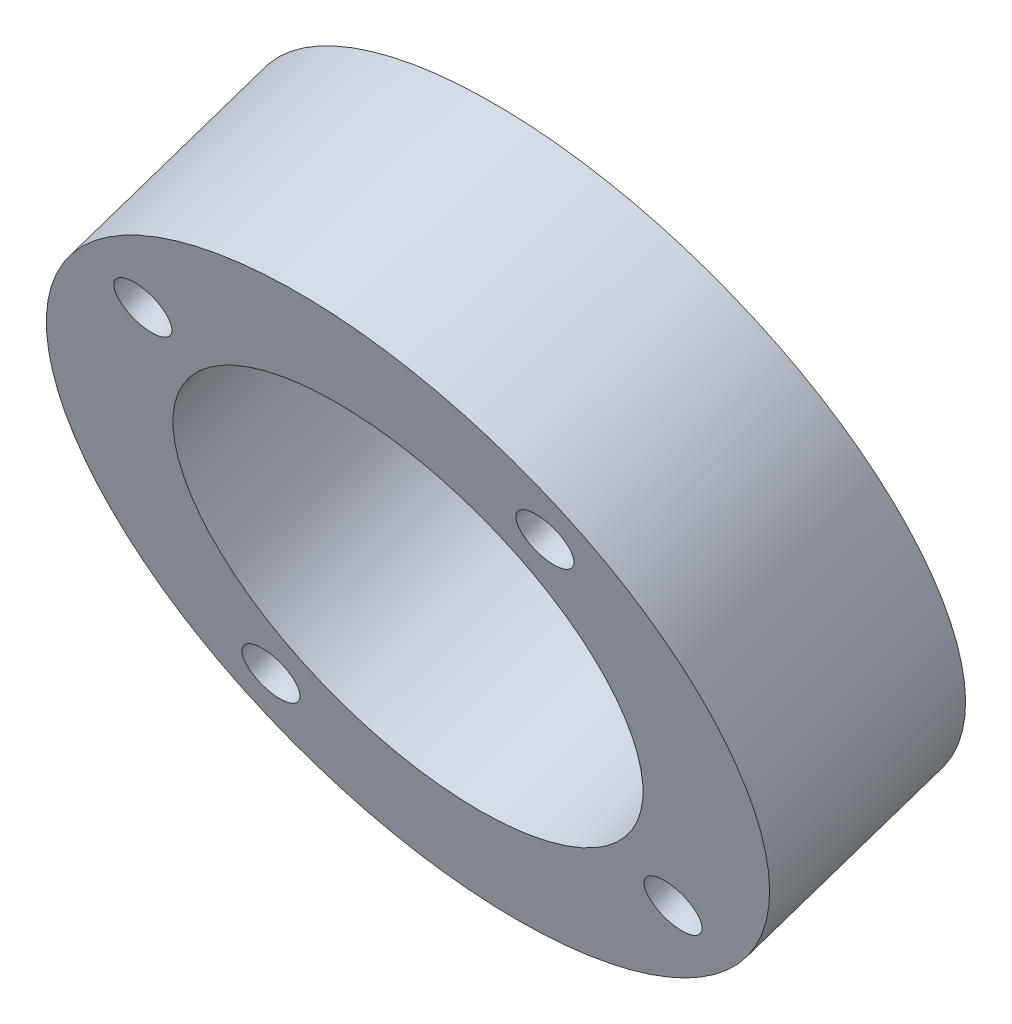
ISO-10303-21;
HEADER;
FILE_DESCRIPTION(('STEP AP214'),'2;1');
FILE_NAME('part.step','',(''),(''),'','','');
FILE_SCHEMA(('AUTOMOTIVE_DESIGN { 1 0 10303 214 1 1 1 1 }'));
ENDSEC;
DATA;
#1=APPLICATION_CONTEXT('core data for automotive mechanical design processes');
#2=APPLICATION_PROTOCOL_DEFINITION('international standard','automotive_design',2000,#1);
#3=PRODUCT_CONTEXT('',#1,'mechanical');
#4=PRODUCT('Part','Part','',(#3));
#5=PRODUCT_RELATED_PRODUCT_CATEGORY('part','',(#4));
#6=PRODUCT_DEFINITION_FORMATION('','',#4);
#7=PRODUCT_DEFINITION_CONTEXT('part definition',#1,'design');
#8=PRODUCT_DEFINITION('design','',#6,#7);
#9=PRODUCT_DEFINITION_SHAPE('','',#8);
#10=(LENGTH_UNIT() NAMED_UNIT(*) SI_UNIT(.MILLI.,.METRE.));
#11=(NAMED_UNIT(*) PLANE_ANGLE_UNIT() SI_UNIT($,.RADIAN.));
#12=(NAMED_UNIT(*) SI_UNIT($,.STERADIAN.) SOLID_ANGLE_UNIT());
#13=UNCERTAINTY_MEASURE_WITH_UNIT(LENGTH_MEASURE(1.E-05),#10,'distance_accuracy_value','');
#14=(GEOMETRIC_REPRESENTATION_CONTEXT(3) GLOBAL_UNCERTAINTY_ASSIGNED_CONTEXT((#13)) GLOBAL_UNIT_ASSIGNED_CONTEXT((#10,
#11,#12)) REPRESENTATION_CONTEXT('',''));
#15=CARTESIAN_POINT('',(0.,0.,0.));
#16=DIRECTION('',(0.,0.,1.));
#17=DIRECTION('',(1.,0.,0.));
#18=AXIS2_PLACEMENT_3D('',#15,#16,#17);
#19=CARTESIAN_POINT('',(-6.05407193696172E-12,474.564066525897,1388.52055057683));
#20=DIRECTION('',(0.,0.31862935507562,-0.947879387941364));
#21=DIRECTION('',(0.,0.947879387941364,0.31862935507562));
#22=AXIS2_PLACEMENT_3D('',#19,#20,#21);
#23=CYLINDRICAL_SURFACE('',#22,31.7500000000517);
#24=CARTESIAN_POINT('',(0.,509.247687902839,1285.34145148044));
#25=DIRECTION('',(0.,-0.31862935507562,0.947879387941364));
#26=DIRECTION('',(0.,-0.947879387941364,-0.31862935507562));
#27=AXIS2_PLACEMENT_3D('',#24,#25,#26);
#28=CIRCLE('',#27,31.7500000000517);
#29=CARTESIAN_POINT('',(0.,479.152517335652,1275.22496945677));
#30=VERTEX_POINT('',#29);
#31=EDGE_CURVE('E41',#30,#30,#28,.T.);
#32=ORIENTED_EDGE('',*,*,#31,.T.);
#33=EDGE_LOOP('',(#32));
#34=FACE_BOUND('',#33,.T.);
#35=CARTESIAN_POINT('',(-1.05950718215803E-12,503.177798688645,1303.39855382073));
#36=DIRECTION('',(0.,-0.318629355075634,0.947879387941359));
#37=DIRECTION('',(0.,-0.947879387941359,-0.318629355075634));
#38=AXIS2_PLACEMENT_3D('',#35,#36,#37);
#39=CIRCLE('',#38,31.7500000000517);
#40=CARTESIAN_POINT('',(-1.05950718215803E-12,473.082628121457,1293.28207179706));
#41=VERTEX_POINT('',#40);
#42=EDGE_CURVE('E10',#41,#41,#39,.T.);
#43=ORIENTED_EDGE('',*,*,#42,.F.);
#44=EDGE_LOOP('',(#43));
#45=FACE_BOUND('',#44,.T.);
#46=ADVANCED_FACE('F34',(#34,#45),#23,.T.);
#47=CARTESIAN_POINT('',(0.,509.247687902839,1285.34145148044));
#48=DIRECTION('',(0.,-0.31862935507562,0.947879387941364));
#49=DIRECTION('',(0.,-0.947879387941364,-0.31862935507562));
#50=AXIS2_PLACEMENT_3D('',#47,#48,#49);
#51=PLANE('',#50);
#52=CARTESIAN_POINT('',(-18.5217782497932,526.804099733783,1291.243033739));
#53=DIRECTION('',(0.,0.31862935507562,-0.947879387941364));
#54=DIRECTION('',(0.,0.947879387941364,0.31862935507562));
#55=AXIS2_PLACEMENT_3D('',#52,#53,#54);
#56=CIRCLE('',#55,2.55269999999999);
#57=CARTESIAN_POINT('',(-18.5217782497932,529.223751447381,1292.05639889371));
#58=VERTEX_POINT('',#57);
#59=EDGE_CURVE('E76',#58,#58,#56,.T.);
#60=ORIENTED_EDGE('',*,*,#59,.F.);
#61=EDGE_LOOP('',(#60));
#62=FACE_BOUND('',#61,.T.);
#63=CARTESIAN_POINT('',(18.5217782496758,526.804099733782,1291.24303373901));
#64=DIRECTION('',(0.,0.31862935507562,-0.947879387941364));
#65=DIRECTION('',(0.,0.947879387941364,0.31862935507562));
#66=AXIS2_PLACEMENT_3D('',#63,#64,#65);
#67=CIRCLE('',#66,2.55269999999999);
#68=CARTESIAN_POINT('',(18.5217782496758,529.22375144738,1292.05639889371));
#69=VERTEX_POINT('',#68);
#70=EDGE_CURVE('E69',#69,#69,#67,.T.);
#71=ORIENTED_EDGE('',*,*,#70,.F.);
#72=EDGE_LOOP('',(#71));
#73=FACE_BOUND('',#72,.T.);
#74=CARTESIAN_POINT('',(18.5217782496758,491.691276071894,1279.43986922187));
#75=DIRECTION('',(0.,0.31862935507562,-0.947879387941364));
#76=DIRECTION('',(0.,0.947879387941364,0.31862935507562));
#77=AXIS2_PLACEMENT_3D('',#74,#75,#76);
#78=CIRCLE('',#77,2.55269999999999);
#79=CARTESIAN_POINT('',(18.5217782496758,494.110927785492,1280.25323437658));
#80=VERTEX_POINT('',#79);
#81=EDGE_CURVE('E61',#80,#80,#78,.T.);
#82=ORIENTED_EDGE('',*,*,#81,.F.);
#83=EDGE_LOOP('',(#82));
#84=FACE_BOUND('',#83,.T.);
#85=CARTESIAN_POINT('',(-18.5217782497932,491.691276071895,1279.43986922187));
#86=DIRECTION('',(0.,0.31862935507562,-0.947879387941364));
#87=DIRECTION('',(0.,0.947879387941364,0.31862935507562));
#88=AXIS2_PLACEMENT_3D('',#85,#86,#87);
#89=CIRCLE('',#88,2.55269999999999);
#90=CARTESIAN_POINT('',(-18.5217782497932,494.110927785493,1280.25323437657));
#91=VERTEX_POINT('',#90);
#92=EDGE_CURVE('E50',#91,#91,#89,.T.);
#93=ORIENTED_EDGE('',*,*,#92,.F.);
#94=EDGE_LOOP('',(#93));
#95=FACE_BOUND('',#94,.T.);
#96=ORIENTED_EDGE('',*,*,#31,.F.);
#97=EDGE_LOOP('',(#96));
#98=FACE_BOUND('',#97,.T.);
#99=CARTESIAN_POINT('',(0.,509.247687902839,1285.34145148044));
#100=DIRECTION('',(0.,-0.31862935507562,0.947879387941364));
#101=DIRECTION('',(0.,-0.947879387941364,-0.31862935507562));
#102=AXIS2_PLACEMENT_3D('',#99,#100,#101);
#103=CIRCLE('',#102,20.6375000000518);
#104=CARTESIAN_POINT('',(0.,489.68582703415,1278.76573816505));
#105=VERTEX_POINT('',#104);
#106=EDGE_CURVE('E46',#105,#105,#103,.T.);
#107=ORIENTED_EDGE('',*,*,#106,.T.);
#108=EDGE_LOOP('',(#107));
#109=FACE_BOUND('',#108,.T.);
#110=ADVANCED_FACE('F82',(#62,#73,#84,#95,#98,#109),#51,.F.);
#111=CARTESIAN_POINT('',(-6.05407193696172E-12,474.564066525897,1388.52055057683));
#112=DIRECTION('',(0.,0.31862935507562,-0.947879387941364));
#113=DIRECTION('',(0.,0.947879387941364,0.31862935507562));
#114=AXIS2_PLACEMENT_3D('',#111,#112,#113);
#115=CYLINDRICAL_SURFACE('',#114,20.6375000000518);
#116=ORIENTED_EDGE('',*,*,#106,.F.);
#117=EDGE_LOOP('',(#116));
#118=FACE_BOUND('',#117,.T.);
#119=CARTESIAN_POINT('',(-1.05950718215803E-12,503.177798688645,1303.39855382073));
#120=DIRECTION('',(0.,-0.318629355075634,0.947879387941359));
#121=DIRECTION('',(0.,-0.947879387941359,-0.318629355075634));
#122=AXIS2_PLACEMENT_3D('',#119,#120,#121);
#123=CIRCLE('',#122,20.6375000000518);
#124=CARTESIAN_POINT('',(-1.05950718215803E-12,483.615937819956,1296.82284050534));
#125=VERTEX_POINT('',#124);
#126=EDGE_CURVE('E53',#125,#125,#123,.T.);
#127=ORIENTED_EDGE('',*,*,#126,.T.);
#128=EDGE_LOOP('',(#127));
#129=FACE_BOUND('',#128,.T.);
#130=ADVANCED_FACE('F85',(#118,#129),#115,.F.);
#131=CARTESIAN_POINT('',(0.,503.177798688645,1303.39855382073));
#132=DIRECTION('',(0.,-0.318629355075634,0.947879387941359));
#133=DIRECTION('',(0.,-0.947879387941359,-0.318629355075634));
#134=AXIS2_PLACEMENT_3D('',#131,#132,#133);
#135=PLANE('',#134);
#136=CARTESIAN_POINT('',(-18.5217782497932,520.734210519589,1309.3001360793));
#137=DIRECTION('',(0.,-0.318629355075634,0.947879387941359));
#138=DIRECTION('',(0.,-0.947879387941359,-0.318629355075634));
#139=AXIS2_PLACEMENT_3D('',#136,#137,#138);
#140=CIRCLE('',#139,2.55269999999999);
#141=CARTESIAN_POINT('',(-18.5217782497932,518.314558805991,1308.4867709246));
#142=VERTEX_POINT('',#141);
#143=EDGE_CURVE('E73',#142,#142,#140,.T.);
#144=ORIENTED_EDGE('',*,*,#143,.F.);
#145=EDGE_LOOP('',(#144));
#146=FACE_BOUND('',#145,.T.);
#147=CARTESIAN_POINT('',(18.5217782496758,520.734210519589,1309.3001360793));
#148=DIRECTION('',(0.,-0.318629355075634,0.947879387941359));
#149=DIRECTION('',(0.,-0.947879387941359,-0.318629355075634));
#150=AXIS2_PLACEMENT_3D('',#147,#148,#149);
#151=CIRCLE('',#150,2.55269999999999);
#152=CARTESIAN_POINT('',(18.5217782496758,518.314558805991,1308.4867709246));
#153=VERTEX_POINT('',#152);
#154=EDGE_CURVE('E37',#153,#153,#151,.T.);
#155=ORIENTED_EDGE('',*,*,#154,.F.);
#156=EDGE_LOOP('',(#155));
#157=FACE_BOUND('',#156,.T.);
#158=CARTESIAN_POINT('',(18.5217782496758,485.621386857701,1297.49697156217));
#159=DIRECTION('',(0.,-0.318629355075634,0.947879387941359));
#160=DIRECTION('',(0.,-0.947879387941359,-0.318629355075634));
#161=AXIS2_PLACEMENT_3D('',#158,#159,#160);
#162=CIRCLE('',#161,2.55269999999999);
#163=CARTESIAN_POINT('',(18.5217782496758,483.201735144103,1296.68360640746));
#164=VERTEX_POINT('',#163);
#165=EDGE_CURVE('E59',#164,#164,#162,.T.);
#166=ORIENTED_EDGE('',*,*,#165,.F.);
#167=EDGE_LOOP('',(#166));
#168=FACE_BOUND('',#167,.T.);
#169=CARTESIAN_POINT('',(-18.5217782497932,485.621386857701,1297.49697156217));
#170=DIRECTION('',(0.,-0.318629355075634,0.947879387941359));
#171=DIRECTION('',(0.,-0.947879387941359,-0.318629355075634));
#172=AXIS2_PLACEMENT_3D('',#169,#170,#171);
#173=CIRCLE('',#172,2.55269999999999);
#174=CARTESIAN_POINT('',(-18.5217782497932,483.201735144103,1296.68360640746));
#175=VERTEX_POINT('',#174);
#176=EDGE_CURVE('E57',#175,#175,#173,.T.);
#177=ORIENTED_EDGE('',*,*,#176,.F.);
#178=EDGE_LOOP('',(#177));
#179=FACE_BOUND('',#178,.T.);
#180=ORIENTED_EDGE('',*,*,#126,.F.);
#181=EDGE_LOOP('',(#180));
#182=FACE_BOUND('',#181,.T.);
#183=ORIENTED_EDGE('',*,*,#42,.T.);
#184=EDGE_LOOP('',(#183));
#185=FACE_BOUND('',#184,.T.);
#186=ADVANCED_FACE('F97',(#146,#157,#168,#179,#182,#185),#135,.T.);
#187=CARTESIAN_POINT('',(-18.5217782497932,491.691276071895,1279.43986922187));
#188=DIRECTION('',(0.,0.31862935507562,-0.947879387941364));
#189=DIRECTION('',(0.,0.947879387941364,0.31862935507562));
#190=AXIS2_PLACEMENT_3D('',#187,#188,#189);
#191=CYLINDRICAL_SURFACE('',#190,2.55269999999999);
#192=ORIENTED_EDGE('',*,*,#176,.T.);
#193=EDGE_LOOP('',(#192));
#194=FACE_BOUND('',#193,.T.);
#195=ORIENTED_EDGE('',*,*,#92,.T.);
#196=EDGE_LOOP('',(#195));
#197=FACE_BOUND('',#196,.T.);
#198=ADVANCED_FACE('F102',(#194,#197),#191,.F.);
#199=CARTESIAN_POINT('',(18.5217782496758,491.691276071894,1279.43986922187));
#200=DIRECTION('',(0.,0.31862935507562,-0.947879387941364));
#201=DIRECTION('',(0.,0.947879387941364,0.31862935507562));
#202=AXIS2_PLACEMENT_3D('',#199,#200,#201);
#203=CYLINDRICAL_SURFACE('',#202,2.55269999999999);
#204=ORIENTED_EDGE('',*,*,#165,.T.);
#205=EDGE_LOOP('',(#204));
#206=FACE_BOUND('',#205,.T.);
#207=ORIENTED_EDGE('',*,*,#81,.T.);
#208=EDGE_LOOP('',(#207));
#209=FACE_BOUND('',#208,.T.);
#210=ADVANCED_FACE('F108',(#206,#209),#203,.F.);
#211=CARTESIAN_POINT('',(18.5217782496758,526.804099733782,1291.24303373901));
#212=DIRECTION('',(0.,0.31862935507562,-0.947879387941364));
#213=DIRECTION('',(0.,0.947879387941364,0.31862935507562));
#214=AXIS2_PLACEMENT_3D('',#211,#212,#213);
#215=CYLINDRICAL_SURFACE('',#214,2.55269999999999);
#216=ORIENTED_EDGE('',*,*,#154,.T.);
#217=EDGE_LOOP('',(#216));
#218=FACE_BOUND('',#217,.T.);
#219=ORIENTED_EDGE('',*,*,#70,.T.);
#220=EDGE_LOOP('',(#219));
#221=FACE_BOUND('',#220,.T.);
#222=ADVANCED_FACE('F148',(#218,#221),#215,.F.);
#223=CARTESIAN_POINT('',(-18.5217782497932,526.804099733783,1291.243033739));
#224=DIRECTION('',(0.,0.31862935507562,-0.947879387941364));
#225=DIRECTION('',(0.,0.947879387941364,0.31862935507562));
#226=AXIS2_PLACEMENT_3D('',#223,#224,#225);
#227=CYLINDRICAL_SURFACE('',#226,2.55269999999999);
#228=ORIENTED_EDGE('',*,*,#143,.T.);
#229=EDGE_LOOP('',(#228));
#230=FACE_BOUND('',#229,.T.);
#231=ORIENTED_EDGE('',*,*,#59,.T.);
#232=EDGE_LOOP('',(#231));
#233=FACE_BOUND('',#232,.T.);
#234=ADVANCED_FACE('F80',(#230,#233),#227,.F.);
#235=CLOSED_SHELL('',(#46,#110,#130,#186,#198,#210,#222,#234));
#236=MANIFOLD_SOLID_BREP('B2',#235);
#237=ADVANCED_BREP_SHAPE_REPRESENTATION('',(#18,#236),#14);
#238=SHAPE_DEFINITION_REPRESENTATION(#9,#237);
ENDSEC;
END-ISO-10303-21;
